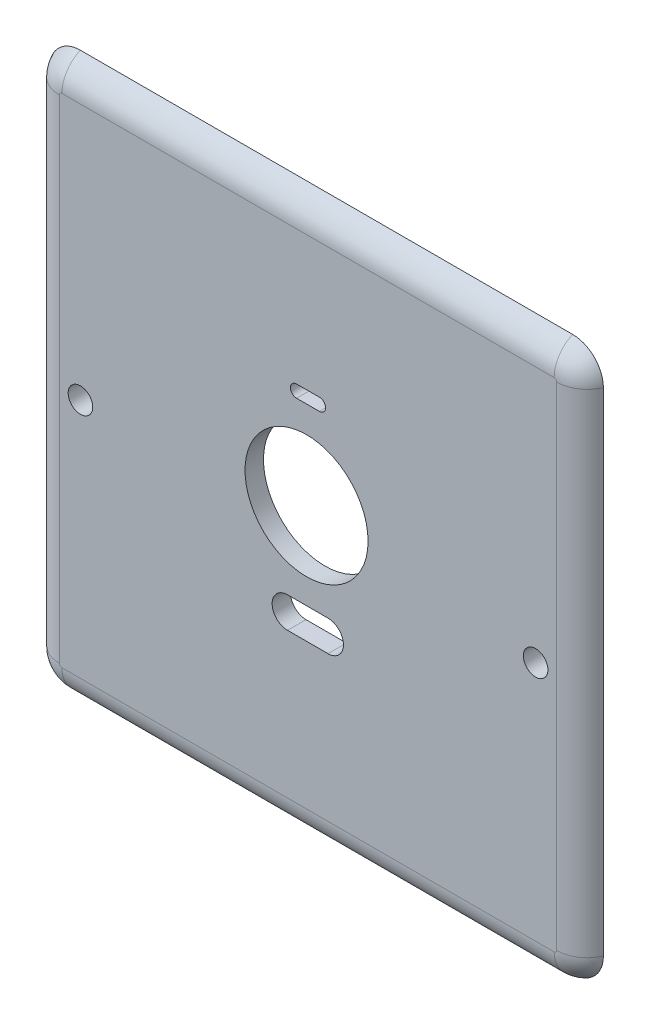
ISO-10303-21;
HEADER;
FILE_DESCRIPTION(('STEP AP214'),'2;1');
FILE_NAME('part.step','',(''),(''),'','','');
FILE_SCHEMA(('AUTOMOTIVE_DESIGN { 1 0 10303 214 1 1 1 1 }'));
ENDSEC;
DATA;
#1=APPLICATION_CONTEXT('core data for automotive mechanical design processes');
#2=APPLICATION_PROTOCOL_DEFINITION('international standard','automotive_design',2000,#1);
#3=PRODUCT_CONTEXT('',#1,'mechanical');
#4=PRODUCT('Part','Part','',(#3));
#5=PRODUCT_RELATED_PRODUCT_CATEGORY('part','',(#4));
#6=PRODUCT_DEFINITION_FORMATION('','',#4);
#7=PRODUCT_DEFINITION_CONTEXT('part definition',#1,'design');
#8=PRODUCT_DEFINITION('design','',#6,#7);
#9=PRODUCT_DEFINITION_SHAPE('','',#8);
#10=(LENGTH_UNIT() NAMED_UNIT(*) SI_UNIT(.MILLI.,.METRE.));
#11=(NAMED_UNIT(*) PLANE_ANGLE_UNIT() SI_UNIT($,.RADIAN.));
#12=(NAMED_UNIT(*) SI_UNIT($,.STERADIAN.) SOLID_ANGLE_UNIT());
#13=UNCERTAINTY_MEASURE_WITH_UNIT(LENGTH_MEASURE(1.E-05),#10,'distance_accuracy_value','');
#14=(GEOMETRIC_REPRESENTATION_CONTEXT(3) GLOBAL_UNCERTAINTY_ASSIGNED_CONTEXT((#13)) GLOBAL_UNIT_ASSIGNED_CONTEXT((#10,
#11,#12)) REPRESENTATION_CONTEXT('',''));
#15=CARTESIAN_POINT('',(0.,0.,0.));
#16=DIRECTION('',(0.,0.,1.));
#17=DIRECTION('',(1.,0.,0.));
#18=AXIS2_PLACEMENT_3D('',#15,#16,#17);
#19=CARTESIAN_POINT('',(0.,0.,3.));
#20=DIRECTION('',(0.,0.,1.));
#21=DIRECTION('',(1.,0.,0.));
#22=AXIS2_PLACEMENT_3D('',#19,#20,#21);
#23=PLANE('',#22);
#24=CARTESIAN_POINT('',(-54.5834797116528,-32.1286196555586,3.));
#25=DIRECTION('',(0.,0.,1.));
#26=DIRECTION('',(1.,0.,0.));
#27=AXIS2_PLACEMENT_3D('',#24,#25,#26);
#28=CIRCLE('',#27,2.5);
#29=CARTESIAN_POINT('',(-54.5834797116528,-29.6286196555586,3.));
#30=VERTEX_POINT('',#29);
#31=CARTESIAN_POINT('',(-54.5834797116528,-34.6286196555586,3.));
#32=VERTEX_POINT('',#31);
#33=EDGE_CURVE('E53',#30,#32,#28,.T.);
#34=ORIENTED_EDGE('',*,*,#33,.F.);
#35=DIRECTION('',(-1.,0.,0.));
#36=VECTOR('',#35,1.);
#37=CARTESIAN_POINT('',(-54.5834797116528,-29.6286196555586,3.));
#38=LINE('',#37,#36);
#39=CARTESIAN_POINT('',(-47.9966224562857,-29.6286196555586,3.));
#40=VERTEX_POINT('',#39);
#41=EDGE_CURVE('E172',#40,#30,#38,.T.);
#42=ORIENTED_EDGE('',*,*,#41,.F.);
#43=CARTESIAN_POINT('',(-47.9966224562857,-32.1286196555586,3.));
#44=DIRECTION('',(0.,0.,1.));
#45=DIRECTION('',(1.,0.,0.));
#46=AXIS2_PLACEMENT_3D('',#43,#44,#45);
#47=CIRCLE('',#46,2.5);
#48=CARTESIAN_POINT('',(-47.9966224562857,-34.6286196555586,3.));
#49=VERTEX_POINT('',#48);
#50=EDGE_CURVE('E175',#49,#40,#47,.T.);
#51=ORIENTED_EDGE('',*,*,#50,.F.);
#52=DIRECTION('',(1.,0.,0.));
#53=VECTOR('',#52,1.);
#54=CARTESIAN_POINT('',(-54.5834797116528,-34.6286196555586,3.));
#55=LINE('',#54,#53);
#56=EDGE_CURVE('E184',#32,#49,#55,.T.);
#57=ORIENTED_EDGE('',*,*,#56,.F.);
#58=EDGE_LOOP('',(#34,#42,#51,#57));
#59=FACE_BOUND('',#58,.T.);
#60=CARTESIAN_POINT('',(-53.1136142063013,-0.228696408480503,3.));
#61=DIRECTION('',(0.,0.,1.));
#62=DIRECTION('',(1.,0.,0.));
#63=AXIS2_PLACEMENT_3D('',#60,#61,#62);
#64=CIRCLE('',#63,1.);
#65=CARTESIAN_POINT('',(-53.1136142063013,0.771303591519498,3.));
#66=VERTEX_POINT('',#65);
#67=CARTESIAN_POINT('',(-53.1136142063013,-1.2286964084805,3.));
#68=VERTEX_POINT('',#67);
#69=EDGE_CURVE('E61',#66,#68,#64,.T.);
#70=ORIENTED_EDGE('',*,*,#69,.F.);
#71=DIRECTION('',(-1.,0.,0.));
#72=VECTOR('',#71,1.);
#73=CARTESIAN_POINT('',(-53.1136142063013,0.771303591519498,3.));
#74=LINE('',#73,#72);
#75=CARTESIAN_POINT('',(-49.3974603565752,0.771303591519498,3.));
#76=VERTEX_POINT('',#75);
#77=EDGE_CURVE('E199',#76,#66,#74,.T.);
#78=ORIENTED_EDGE('',*,*,#77,.F.);
#79=CARTESIAN_POINT('',(-49.3974603565752,-0.228696408480503,3.));
#80=DIRECTION('',(0.,0.,1.));
#81=DIRECTION('',(1.,0.,0.));
#82=AXIS2_PLACEMENT_3D('',#79,#80,#81);
#83=CIRCLE('',#82,1.);
#84=CARTESIAN_POINT('',(-49.3974603565752,-1.2286964084805,3.));
#85=VERTEX_POINT('',#84);
#86=EDGE_CURVE('E214',#85,#76,#83,.T.);
#87=ORIENTED_EDGE('',*,*,#86,.F.);
#88=DIRECTION('',(1.,0.,0.));
#89=VECTOR('',#88,1.);
#90=CARTESIAN_POINT('',(-53.1136142063013,-1.2286964084805,3.));
#91=LINE('',#90,#89);
#92=EDGE_CURVE('E210',#68,#85,#91,.T.);
#93=ORIENTED_EDGE('',*,*,#92,.F.);
#94=EDGE_LOOP('',(#70,#78,#87,#93));
#95=FACE_BOUND('',#94,.T.);
#96=CARTESIAN_POINT('',(-88.2383707673014,-19.0513449539287,3.));
#97=DIRECTION('',(0.,0.,1.));
#98=DIRECTION('',(1.,0.,0.));
#99=AXIS2_PLACEMENT_3D('',#96,#97,#98);
#100=CIRCLE('',#99,2.);
#101=CARTESIAN_POINT('',(-86.2383707673014,-19.0513449539287,3.));
#102=VERTEX_POINT('',#101);
#103=EDGE_CURVE('E381',#102,#102,#100,.T.);
#104=ORIENTED_EDGE('',*,*,#103,.F.);
#105=EDGE_LOOP('',(#104));
#106=FACE_BOUND('',#105,.T.);
#107=CARTESIAN_POINT('',(-14.2616292326987,-19.0513449539287,3.));
#108=DIRECTION('',(0.,0.,1.));
#109=DIRECTION('',(1.,0.,0.));
#110=AXIS2_PLACEMENT_3D('',#107,#108,#109);
#111=CIRCLE('',#110,2.);
#112=CARTESIAN_POINT('',(-12.2616292326987,-19.0513449539287,3.));
#113=VERTEX_POINT('',#112);
#114=EDGE_CURVE('E178',#113,#113,#111,.T.);
#115=ORIENTED_EDGE('',*,*,#114,.F.);
#116=EDGE_LOOP('',(#115));
#117=FACE_BOUND('',#116,.T.);
#118=CARTESIAN_POINT('',(-51.491961851315,-15.5450237044671,3.));
#119=DIRECTION('',(0.,0.,1.));
#120=DIRECTION('',(1.,0.,0.));
#121=AXIS2_PLACEMENT_3D('',#118,#119,#120);
#122=CIRCLE('',#121,10.);
#123=CARTESIAN_POINT('',(-41.491961851315,-15.5450237044671,3.));
#124=VERTEX_POINT('',#123);
#125=EDGE_CURVE('E191',#124,#124,#122,.T.);
#126=ORIENTED_EDGE('',*,*,#125,.F.);
#127=EDGE_LOOP('',(#126));
#128=FACE_BOUND('',#127,.T.);
#129=DIRECTION('',(1.,0.,0.));
#130=VECTOR('',#129,1.);
#131=CARTESIAN_POINT('',(-91.25,22.6049243050442,3.));
#132=LINE('',#131,#130);
#133=CARTESIAN_POINT('',(-11.25,22.6049243050442,3.));
#134=VERTEX_POINT('',#133);
#135=CARTESIAN_POINT('',(-91.25,22.6049243050442,3.));
#136=VERTEX_POINT('',#135);
#137=EDGE_CURVE('E45',#134,#136,#132,.F.);
#138=ORIENTED_EDGE('',*,*,#137,.T.);
#139=CARTESIAN_POINT('',(-91.25,22.1875,3.));
#140=DIRECTION('',(0.,0.,1.));
#141=DIRECTION('',(1.,0.,0.));
#142=AXIS2_PLACEMENT_3D('',#139,#140,#141);
#143=CIRCLE('',#142,0.41742430504416);
#144=CARTESIAN_POINT('',(-91.6674243050442,22.1875,3.));
#145=VERTEX_POINT('',#144);
#146=EDGE_CURVE('E11',#136,#145,#143,.T.);
#147=ORIENTED_EDGE('',*,*,#146,.T.);
#148=DIRECTION('',(0.,1.,0.));
#149=VECTOR('',#148,1.);
#150=CARTESIAN_POINT('',(-91.6674243050442,-57.8125,3.));
#151=LINE('',#150,#149);
#152=CARTESIAN_POINT('',(-91.6674243050442,-57.8125,3.));
#153=VERTEX_POINT('',#152);
#154=EDGE_CURVE('E252',#145,#153,#151,.F.);
#155=ORIENTED_EDGE('',*,*,#154,.T.);
#156=CARTESIAN_POINT('',(-91.25,-57.8125,3.));
#157=DIRECTION('',(0.,0.,1.));
#158=DIRECTION('',(1.,0.,0.));
#159=AXIS2_PLACEMENT_3D('',#156,#157,#158);
#160=CIRCLE('',#159,0.41742430504416);
#161=CARTESIAN_POINT('',(-91.25,-58.2299243050442,3.));
#162=VERTEX_POINT('',#161);
#163=EDGE_CURVE('E254',#153,#162,#160,.T.);
#164=ORIENTED_EDGE('',*,*,#163,.T.);
#165=DIRECTION('',(-1.,0.,0.));
#166=VECTOR('',#165,1.);
#167=CARTESIAN_POINT('',(-11.25,-58.2299243050442,3.));
#168=LINE('',#167,#166);
#169=CARTESIAN_POINT('',(-11.25,-58.2299243050442,3.));
#170=VERTEX_POINT('',#169);
#171=EDGE_CURVE('E256',#162,#170,#168,.F.);
#172=ORIENTED_EDGE('',*,*,#171,.T.);
#173=CARTESIAN_POINT('',(-11.25,-57.8125,3.));
#174=DIRECTION('',(0.,0.,1.));
#175=DIRECTION('',(1.,0.,0.));
#176=AXIS2_PLACEMENT_3D('',#173,#174,#175);
#177=CIRCLE('',#176,0.41742430504416);
#178=CARTESIAN_POINT('',(-10.8325756949558,-57.8125,3.));
#179=VERTEX_POINT('',#178);
#180=EDGE_CURVE('E258',#170,#179,#177,.T.);
#181=ORIENTED_EDGE('',*,*,#180,.T.);
#182=DIRECTION('',(0.,-1.,0.));
#183=VECTOR('',#182,1.);
#184=CARTESIAN_POINT('',(-10.8325756949559,22.1875,3.));
#185=LINE('',#184,#183);
#186=CARTESIAN_POINT('',(-10.8325756949559,22.1875,3.));
#187=VERTEX_POINT('',#186);
#188=EDGE_CURVE('E260',#179,#187,#185,.F.);
#189=ORIENTED_EDGE('',*,*,#188,.T.);
#190=CARTESIAN_POINT('',(-11.25,22.1875,3.));
#191=DIRECTION('',(0.,0.,1.));
#192=DIRECTION('',(1.,0.,0.));
#193=AXIS2_PLACEMENT_3D('',#190,#191,#192);
#194=CIRCLE('',#193,0.41742430504416);
#195=EDGE_CURVE('E262',#187,#134,#194,.T.);
#196=ORIENTED_EDGE('',*,*,#195,.T.);
#197=EDGE_LOOP('',(#138,#147,#155,#164,#172,#181,#189,#196));
#198=FACE_BOUND('',#197,.T.);
#199=ADVANCED_FACE('F36',(#59,#95,#106,#117,#128,#198),#23,.T.);
#200=CARTESIAN_POINT('',(0.,0.,0.));
#201=DIRECTION('',(0.,0.,1.));
#202=DIRECTION('',(1.,0.,0.));
#203=AXIS2_PLACEMENT_3D('',#200,#201,#202);
#204=PLANE('',#203);
#205=DIRECTION('',(-1.,0.,0.));
#206=VECTOR('',#205,1.);
#207=CARTESIAN_POINT('',(-54.5834797116528,-29.6286196555586,0.));
#208=LINE('',#207,#206);
#209=CARTESIAN_POINT('',(-47.9966224562857,-29.6286196555586,0.));
#210=VERTEX_POINT('',#209);
#211=CARTESIAN_POINT('',(-54.5834797116528,-29.6286196555586,0.));
#212=VERTEX_POINT('',#211);
#213=EDGE_CURVE('E159',#210,#212,#208,.T.);
#214=ORIENTED_EDGE('',*,*,#213,.T.);
#215=CARTESIAN_POINT('',(-54.5834797116528,-32.1286196555586,0.));
#216=DIRECTION('',(0.,0.,1.));
#217=DIRECTION('',(1.,0.,0.));
#218=AXIS2_PLACEMENT_3D('',#215,#216,#217);
#219=CIRCLE('',#218,2.5);
#220=CARTESIAN_POINT('',(-54.5834797116528,-34.6286196555586,0.));
#221=VERTEX_POINT('',#220);
#222=EDGE_CURVE('E153',#212,#221,#219,.T.);
#223=ORIENTED_EDGE('',*,*,#222,.T.);
#224=DIRECTION('',(1.,0.,0.));
#225=VECTOR('',#224,1.);
#226=CARTESIAN_POINT('',(-54.5834797116528,-34.6286196555586,0.));
#227=LINE('',#226,#225);
#228=CARTESIAN_POINT('',(-47.9966224562857,-34.6286196555586,0.));
#229=VERTEX_POINT('',#228);
#230=EDGE_CURVE('E163',#221,#229,#227,.T.);
#231=ORIENTED_EDGE('',*,*,#230,.T.);
#232=CARTESIAN_POINT('',(-47.9966224562857,-32.1286196555586,0.));
#233=DIRECTION('',(0.,0.,1.));
#234=DIRECTION('',(1.,0.,0.));
#235=AXIS2_PLACEMENT_3D('',#232,#233,#234);
#236=CIRCLE('',#235,2.5);
#237=EDGE_CURVE('E167',#229,#210,#236,.T.);
#238=ORIENTED_EDGE('',*,*,#237,.T.);
#239=EDGE_LOOP('',(#214,#223,#231,#238));
#240=FACE_BOUND('',#239,.T.);
#241=DIRECTION('',(-1.,0.,0.));
#242=VECTOR('',#241,1.);
#243=CARTESIAN_POINT('',(-53.1136142063013,0.771303591519498,0.));
#244=LINE('',#243,#242);
#245=CARTESIAN_POINT('',(-49.3974603565752,0.771303591519498,0.));
#246=VERTEX_POINT('',#245);
#247=CARTESIAN_POINT('',(-53.1136142063013,0.771303591519498,0.));
#248=VERTEX_POINT('',#247);
#249=EDGE_CURVE('E205',#246,#248,#244,.T.);
#250=ORIENTED_EDGE('',*,*,#249,.T.);
#251=CARTESIAN_POINT('',(-53.1136142063013,-0.228696408480503,0.));
#252=DIRECTION('',(0.,0.,1.));
#253=DIRECTION('',(1.,0.,0.));
#254=AXIS2_PLACEMENT_3D('',#251,#252,#253);
#255=CIRCLE('',#254,1.);
#256=CARTESIAN_POINT('',(-53.1136142063013,-1.2286964084805,0.));
#257=VERTEX_POINT('',#256);
#258=EDGE_CURVE('E195',#248,#257,#255,.T.);
#259=ORIENTED_EDGE('',*,*,#258,.T.);
#260=DIRECTION('',(1.,0.,0.));
#261=VECTOR('',#260,1.);
#262=CARTESIAN_POINT('',(-53.1136142063013,-1.2286964084805,0.));
#263=LINE('',#262,#261);
#264=CARTESIAN_POINT('',(-49.3974603565752,-1.2286964084805,0.));
#265=VERTEX_POINT('',#264);
#266=EDGE_CURVE('E198',#257,#265,#263,.T.);
#267=ORIENTED_EDGE('',*,*,#266,.T.);
#268=CARTESIAN_POINT('',(-49.3974603565752,-0.228696408480503,0.));
#269=DIRECTION('',(0.,0.,1.));
#270=DIRECTION('',(1.,0.,0.));
#271=AXIS2_PLACEMENT_3D('',#268,#269,#270);
#272=CIRCLE('',#271,1.);
#273=EDGE_CURVE('E202',#265,#246,#272,.T.);
#274=ORIENTED_EDGE('',*,*,#273,.T.);
#275=EDGE_LOOP('',(#250,#259,#267,#274));
#276=FACE_BOUND('',#275,.T.);
#277=CARTESIAN_POINT('',(-88.2383707673014,-19.0513449539287,0.));
#278=DIRECTION('',(0.,0.,1.));
#279=DIRECTION('',(1.,0.,0.));
#280=AXIS2_PLACEMENT_3D('',#277,#278,#279);
#281=CIRCLE('',#280,2.);
#282=CARTESIAN_POINT('',(-86.2383707673014,-19.0513449539287,0.));
#283=VERTEX_POINT('',#282);
#284=EDGE_CURVE('E211',#283,#283,#281,.T.);
#285=ORIENTED_EDGE('',*,*,#284,.T.);
#286=EDGE_LOOP('',(#285));
#287=FACE_BOUND('',#286,.T.);
#288=CARTESIAN_POINT('',(-14.2616292326987,-19.0513449539287,0.));
#289=DIRECTION('',(0.,0.,1.));
#290=DIRECTION('',(1.,0.,0.));
#291=AXIS2_PLACEMENT_3D('',#288,#289,#290);
#292=CIRCLE('',#291,2.);
#293=CARTESIAN_POINT('',(-12.2616292326987,-19.0513449539287,0.));
#294=VERTEX_POINT('',#293);
#295=EDGE_CURVE('E383',#294,#294,#292,.T.);
#296=ORIENTED_EDGE('',*,*,#295,.T.);
#297=EDGE_LOOP('',(#296));
#298=FACE_BOUND('',#297,.T.);
#299=CARTESIAN_POINT('',(-51.491961851315,-15.5450237044671,0.));
#300=DIRECTION('',(0.,0.,1.));
#301=DIRECTION('',(1.,0.,0.));
#302=AXIS2_PLACEMENT_3D('',#299,#300,#301);
#303=CIRCLE('',#302,10.);
#304=CARTESIAN_POINT('',(-41.491961851315,-15.5450237044671,0.));
#305=VERTEX_POINT('',#304);
#306=EDGE_CURVE('E225',#305,#305,#303,.T.);
#307=ORIENTED_EDGE('',*,*,#306,.T.);
#308=EDGE_LOOP('',(#307));
#309=FACE_BOUND('',#308,.T.);
#310=DIRECTION('',(0.,-1.,0.));
#311=VECTOR('',#310,1.);
#312=CARTESIAN_POINT('',(-96.25,27.1875,0.));
#313=LINE('',#312,#311);
#314=CARTESIAN_POINT('',(-96.25,22.1875,0.));
#315=VERTEX_POINT('',#314);
#316=CARTESIAN_POINT('',(-96.25,-57.8125,0.));
#317=VERTEX_POINT('',#316);
#318=EDGE_CURVE('E231',#315,#317,#313,.T.);
#319=ORIENTED_EDGE('',*,*,#318,.F.);
#320=CARTESIAN_POINT('',(-91.25,22.1875,0.));
#321=DIRECTION('',(0.,0.,1.));
#322=DIRECTION('',(1.,0.,0.));
#323=AXIS2_PLACEMENT_3D('',#320,#321,#322);
#324=CIRCLE('',#323,5.);
#325=CARTESIAN_POINT('',(-91.25,27.1875,0.));
#326=VERTEX_POINT('',#325);
#327=EDGE_CURVE('E249',#315,#326,#324,.F.);
#328=ORIENTED_EDGE('',*,*,#327,.T.);
#329=DIRECTION('',(-1.,0.,0.));
#330=VECTOR('',#329,1.);
#331=CARTESIAN_POINT('',(-96.25,27.1875,0.));
#332=LINE('',#331,#330);
#333=CARTESIAN_POINT('',(-11.2500000000001,27.1875,0.));
#334=VERTEX_POINT('',#333);
#335=EDGE_CURVE('E240',#334,#326,#332,.T.);
#336=ORIENTED_EDGE('',*,*,#335,.F.);
#337=CARTESIAN_POINT('',(-11.25,22.1875,0.));
#338=DIRECTION('',(0.,0.,1.));
#339=DIRECTION('',(1.,0.,0.));
#340=AXIS2_PLACEMENT_3D('',#337,#338,#339);
#341=CIRCLE('',#340,5.);
#342=CARTESIAN_POINT('',(-6.25000000000002,22.1875,0.));
#343=VERTEX_POINT('',#342);
#344=EDGE_CURVE('E247',#334,#343,#341,.F.);
#345=ORIENTED_EDGE('',*,*,#344,.T.);
#346=DIRECTION('',(0.,1.,0.));
#347=VECTOR('',#346,1.);
#348=CARTESIAN_POINT('',(-6.25000000000002,27.1875,0.));
#349=LINE('',#348,#347);
#350=CARTESIAN_POINT('',(-6.25000000000001,-57.8125,0.));
#351=VERTEX_POINT('',#350);
#352=EDGE_CURVE('E237',#351,#343,#349,.T.);
#353=ORIENTED_EDGE('',*,*,#352,.F.);
#354=CARTESIAN_POINT('',(-11.25,-57.8125,0.));
#355=DIRECTION('',(0.,0.,1.));
#356=DIRECTION('',(1.,0.,0.));
#357=AXIS2_PLACEMENT_3D('',#354,#355,#356);
#358=CIRCLE('',#357,5.);
#359=CARTESIAN_POINT('',(-11.25,-62.8125,0.));
#360=VERTEX_POINT('',#359);
#361=EDGE_CURVE('E245',#351,#360,#358,.F.);
#362=ORIENTED_EDGE('',*,*,#361,.T.);
#363=DIRECTION('',(1.,0.,0.));
#364=VECTOR('',#363,1.);
#365=CARTESIAN_POINT('',(-96.25,-62.8125,0.));
#366=LINE('',#365,#364);
#367=CARTESIAN_POINT('',(-91.25,-62.8125,0.));
#368=VERTEX_POINT('',#367);
#369=EDGE_CURVE('E234',#368,#360,#366,.T.);
#370=ORIENTED_EDGE('',*,*,#369,.F.);
#371=CARTESIAN_POINT('',(-91.25,-57.8125,0.));
#372=DIRECTION('',(0.,0.,1.));
#373=DIRECTION('',(1.,0.,0.));
#374=AXIS2_PLACEMENT_3D('',#371,#372,#373);
#375=CIRCLE('',#374,5.);
#376=EDGE_CURVE('E243',#368,#317,#375,.F.);
#377=ORIENTED_EDGE('',*,*,#376,.T.);
#378=EDGE_LOOP('',(#319,#328,#336,#345,#353,#362,#370,#377));
#379=FACE_BOUND('',#378,.T.);
#380=ADVANCED_FACE('F169',(#240,#276,#287,#298,#309,#379),#204,.F.);
#381=CARTESIAN_POINT('',(-11.25,-57.8125,-2.));
#382=DIRECTION('',(0.,0.,-1.));
#383=DIRECTION('',(-1.,0.,0.));
#384=AXIS2_PLACEMENT_3D('',#381,#382,#383);
#385=DEGENERATE_TOROIDAL_SURFACE('',#384,0.41742430504416,5.,.T.);
#386=CARTESIAN_POINT('',(-11.25,-58.2299243050442,-2.));
#387=DIRECTION('',(-1.,0.,0.));
#388=DIRECTION('',(0.,-1.,0.));
#389=AXIS2_PLACEMENT_3D('',#386,#387,#388);
#390=CIRCLE('',#389,5.);
#391=EDGE_CURVE('E279',#360,#170,#390,.T.);
#392=ORIENTED_EDGE('',*,*,#391,.F.);
#393=ORIENTED_EDGE('',*,*,#361,.F.);
#394=CARTESIAN_POINT('',(-10.8325756949558,-57.8125,-2.));
#395=DIRECTION('',(0.,1.,0.));
#396=DIRECTION('',(-1.,0.,0.));
#397=AXIS2_PLACEMENT_3D('',#394,#395,#396);
#398=CIRCLE('',#397,5.);
#399=EDGE_CURVE('E40',#179,#351,#398,.T.);
#400=ORIENTED_EDGE('',*,*,#399,.F.);
#401=ORIENTED_EDGE('',*,*,#180,.F.);
#402=EDGE_LOOP('',(#392,#393,#400,#401));
#403=FACE_BOUND('',#402,.T.);
#404=ADVANCED_FACE('F38',(#403),#385,.T.);
#405=CARTESIAN_POINT('',(-10.8325756949559,27.1875,-2.));
#406=DIRECTION('',(0.,1.,0.));
#407=DIRECTION('',(-1.,0.,0.));
#408=AXIS2_PLACEMENT_3D('',#405,#406,#407);
#409=CYLINDRICAL_SURFACE('',#408,5.);
#410=ORIENTED_EDGE('',*,*,#399,.T.);
#411=ORIENTED_EDGE('',*,*,#352,.T.);
#412=CARTESIAN_POINT('',(-10.8325756949559,22.1875,-2.));
#413=DIRECTION('',(0.,1.,0.));
#414=DIRECTION('',(0.,0.,1.));
#415=AXIS2_PLACEMENT_3D('',#412,#413,#414);
#416=CIRCLE('',#415,5.);
#417=EDGE_CURVE('E277',#187,#343,#416,.T.);
#418=ORIENTED_EDGE('',*,*,#417,.F.);
#419=ORIENTED_EDGE('',*,*,#188,.F.);
#420=EDGE_LOOP('',(#410,#411,#418,#419));
#421=FACE_BOUND('',#420,.T.);
#422=ADVANCED_FACE('F288',(#421),#409,.T.);
#423=CARTESIAN_POINT('',(-96.25,-58.2299243050442,-2.));
#424=DIRECTION('',(1.,0.,0.));
#425=DIRECTION('',(0.,0.,-1.));
#426=AXIS2_PLACEMENT_3D('',#423,#424,#425);
#427=CYLINDRICAL_SURFACE('',#426,5.);
#428=ORIENTED_EDGE('',*,*,#391,.T.);
#429=ORIENTED_EDGE('',*,*,#171,.F.);
#430=CARTESIAN_POINT('',(-91.25,-58.2299243050442,-2.));
#431=DIRECTION('',(-1.,0.,0.));
#432=DIRECTION('',(0.,0.,1.));
#433=AXIS2_PLACEMENT_3D('',#430,#431,#432);
#434=CIRCLE('',#433,5.);
#435=EDGE_CURVE('E274',#368,#162,#434,.T.);
#436=ORIENTED_EDGE('',*,*,#435,.F.);
#437=ORIENTED_EDGE('',*,*,#369,.T.);
#438=EDGE_LOOP('',(#428,#429,#436,#437));
#439=FACE_BOUND('',#438,.T.);
#440=ADVANCED_FACE('F307',(#439),#427,.T.);
#441=CARTESIAN_POINT('',(-11.25,22.1875,-2.));
#442=DIRECTION('',(0.,0.,-1.));
#443=DIRECTION('',(-1.,0.,0.));
#444=AXIS2_PLACEMENT_3D('',#441,#442,#443);
#445=DEGENERATE_TOROIDAL_SURFACE('',#444,0.41742430504416,5.,.T.);
#446=ORIENTED_EDGE('',*,*,#417,.T.);
#447=ORIENTED_EDGE('',*,*,#344,.F.);
#448=CARTESIAN_POINT('',(-11.25,22.6049243050442,-2.));
#449=DIRECTION('',(-1.,0.,0.));
#450=DIRECTION('',(0.,-1.,0.));
#451=AXIS2_PLACEMENT_3D('',#448,#449,#450);
#452=CIRCLE('',#451,5.);
#453=EDGE_CURVE('E271',#134,#334,#452,.T.);
#454=ORIENTED_EDGE('',*,*,#453,.F.);
#455=ORIENTED_EDGE('',*,*,#195,.F.);
#456=EDGE_LOOP('',(#446,#447,#454,#455));
#457=FACE_BOUND('',#456,.T.);
#458=ADVANCED_FACE('F298',(#457),#445,.T.);
#459=CARTESIAN_POINT('',(-91.25,-57.8125,-2.));
#460=DIRECTION('',(0.,0.,-1.));
#461=DIRECTION('',(-1.,0.,0.));
#462=AXIS2_PLACEMENT_3D('',#459,#460,#461);
#463=DEGENERATE_TOROIDAL_SURFACE('',#462,0.41742430504416,5.,.T.);
#464=ORIENTED_EDGE('',*,*,#435,.T.);
#465=ORIENTED_EDGE('',*,*,#163,.F.);
#466=CARTESIAN_POINT('',(-91.6674243050442,-57.8125,-2.));
#467=DIRECTION('',(0.,1.,0.));
#468=DIRECTION('',(-1.,0.,0.));
#469=AXIS2_PLACEMENT_3D('',#466,#467,#468);
#470=CIRCLE('',#469,5.);
#471=EDGE_CURVE('E268',#317,#153,#470,.T.);
#472=ORIENTED_EDGE('',*,*,#471,.F.);
#473=ORIENTED_EDGE('',*,*,#376,.F.);
#474=EDGE_LOOP('',(#464,#465,#472,#473));
#475=FACE_BOUND('',#474,.T.);
#476=ADVANCED_FACE('F310',(#475),#463,.T.);
#477=CARTESIAN_POINT('',(-96.25,22.6049243050442,-2.));
#478=DIRECTION('',(-1.,0.,0.));
#479=DIRECTION('',(0.,0.,1.));
#480=AXIS2_PLACEMENT_3D('',#477,#478,#479);
#481=CYLINDRICAL_SURFACE('',#480,5.);
#482=ORIENTED_EDGE('',*,*,#453,.T.);
#483=ORIENTED_EDGE('',*,*,#335,.T.);
#484=CARTESIAN_POINT('',(-91.25,22.6049243050442,-2.));
#485=DIRECTION('',(-1.,0.,0.));
#486=DIRECTION('',(0.,0.,1.));
#487=AXIS2_PLACEMENT_3D('',#484,#485,#486);
#488=CIRCLE('',#487,5.);
#489=EDGE_CURVE('E266',#136,#326,#488,.T.);
#490=ORIENTED_EDGE('',*,*,#489,.F.);
#491=ORIENTED_EDGE('',*,*,#137,.F.);
#492=EDGE_LOOP('',(#482,#483,#490,#491));
#493=FACE_BOUND('',#492,.T.);
#494=ADVANCED_FACE('F302',(#493),#481,.T.);
#495=CARTESIAN_POINT('',(-91.6674243050442,27.1875,-2.));
#496=DIRECTION('',(0.,-1.,0.));
#497=DIRECTION('',(0.,0.,-1.));
#498=AXIS2_PLACEMENT_3D('',#495,#496,#497);
#499=CYLINDRICAL_SURFACE('',#498,5.);
#500=ORIENTED_EDGE('',*,*,#471,.T.);
#501=ORIENTED_EDGE('',*,*,#154,.F.);
#502=CARTESIAN_POINT('',(-91.6674243050442,22.1875,-2.));
#503=DIRECTION('',(0.,1.,0.));
#504=DIRECTION('',(0.,0.,1.));
#505=AXIS2_PLACEMENT_3D('',#502,#503,#504);
#506=CIRCLE('',#505,5.);
#507=EDGE_CURVE('E228',#315,#145,#506,.T.);
#508=ORIENTED_EDGE('',*,*,#507,.F.);
#509=ORIENTED_EDGE('',*,*,#318,.T.);
#510=EDGE_LOOP('',(#500,#501,#508,#509));
#511=FACE_BOUND('',#510,.T.);
#512=ADVANCED_FACE('F318',(#511),#499,.T.);
#513=CARTESIAN_POINT('',(-91.25,22.1875,-2.));
#514=DIRECTION('',(0.,0.,-1.));
#515=DIRECTION('',(-1.,0.,0.));
#516=AXIS2_PLACEMENT_3D('',#513,#514,#515);
#517=DEGENERATE_TOROIDAL_SURFACE('',#516,0.41742430504416,5.,.T.);
#518=ORIENTED_EDGE('',*,*,#489,.T.);
#519=ORIENTED_EDGE('',*,*,#327,.F.);
#520=ORIENTED_EDGE('',*,*,#507,.T.);
#521=ORIENTED_EDGE('',*,*,#146,.F.);
#522=EDGE_LOOP('',(#518,#519,#520,#521));
#523=FACE_BOUND('',#522,.T.);
#524=ADVANCED_FACE('F316',(#523),#517,.T.);
#525=CARTESIAN_POINT('',(-51.491961851315,-15.5450237044671,0.));
#526=DIRECTION('',(0.,0.,1.));
#527=DIRECTION('',(1.,0.,0.));
#528=AXIS2_PLACEMENT_3D('',#525,#526,#527);
#529=CYLINDRICAL_SURFACE('',#528,10.);
#530=ORIENTED_EDGE('',*,*,#306,.F.);
#531=EDGE_LOOP('',(#530));
#532=FACE_BOUND('',#531,.T.);
#533=ORIENTED_EDGE('',*,*,#125,.T.);
#534=EDGE_LOOP('',(#533));
#535=FACE_BOUND('',#534,.T.);
#536=ADVANCED_FACE('F325',(#532,#535),#529,.F.);
#537=CARTESIAN_POINT('',(-14.2616292326987,-19.0513449539287,0.));
#538=DIRECTION('',(0.,0.,1.));
#539=DIRECTION('',(1.,0.,0.));
#540=AXIS2_PLACEMENT_3D('',#537,#538,#539);
#541=CYLINDRICAL_SURFACE('',#540,2.);
#542=ORIENTED_EDGE('',*,*,#295,.F.);
#543=EDGE_LOOP('',(#542));
#544=FACE_BOUND('',#543,.T.);
#545=ORIENTED_EDGE('',*,*,#114,.T.);
#546=EDGE_LOOP('',(#545));
#547=FACE_BOUND('',#546,.T.);
#548=ADVANCED_FACE('F339',(#544,#547),#541,.F.);
#549=CARTESIAN_POINT('',(-88.2383707673014,-19.0513449539287,0.));
#550=DIRECTION('',(0.,0.,1.));
#551=DIRECTION('',(1.,0.,0.));
#552=AXIS2_PLACEMENT_3D('',#549,#550,#551);
#553=CYLINDRICAL_SURFACE('',#552,2.);
#554=ORIENTED_EDGE('',*,*,#284,.F.);
#555=EDGE_LOOP('',(#554));
#556=FACE_BOUND('',#555,.T.);
#557=ORIENTED_EDGE('',*,*,#103,.T.);
#558=EDGE_LOOP('',(#557));
#559=FACE_BOUND('',#558,.T.);
#560=ADVANCED_FACE('F345',(#556,#559),#553,.F.);
#561=CARTESIAN_POINT('',(-53.1136142063013,-0.228696408480503,0.));
#562=DIRECTION('',(0.,0.,1.));
#563=DIRECTION('',(1.,0.,0.));
#564=AXIS2_PLACEMENT_3D('',#561,#562,#563);
#565=CYLINDRICAL_SURFACE('',#564,1.);
#566=ORIENTED_EDGE('',*,*,#69,.T.);
#567=DIRECTION('',(0.,0.,1.));
#568=VECTOR('',#567,1.);
#569=CARTESIAN_POINT('',(-53.1136142063013,-1.2286964084805,0.));
#570=LINE('',#569,#568);
#571=EDGE_CURVE('E208',#257,#68,#570,.T.);
#572=ORIENTED_EDGE('',*,*,#571,.F.);
#573=ORIENTED_EDGE('',*,*,#258,.F.);
#574=DIRECTION('',(0.,0.,1.));
#575=VECTOR('',#574,1.);
#576=CARTESIAN_POINT('',(-53.1136142063013,0.771303591519498,0.));
#577=LINE('',#576,#575);
#578=EDGE_CURVE('E185',#248,#66,#577,.T.);
#579=ORIENTED_EDGE('',*,*,#578,.T.);
#580=EDGE_LOOP('',(#566,#572,#573,#579));
#581=FACE_BOUND('',#580,.T.);
#582=ADVANCED_FACE('F341',(#581),#565,.F.);
#583=CARTESIAN_POINT('',(-53.1136142063013,0.771303591519498,0.));
#584=DIRECTION('',(0.,1.,0.));
#585=DIRECTION('',(0.,0.,1.));
#586=AXIS2_PLACEMENT_3D('',#583,#584,#585);
#587=PLANE('',#586);
#588=ORIENTED_EDGE('',*,*,#77,.T.);
#589=ORIENTED_EDGE('',*,*,#578,.F.);
#590=ORIENTED_EDGE('',*,*,#249,.F.);
#591=DIRECTION('',(0.,0.,1.));
#592=VECTOR('',#591,1.);
#593=CARTESIAN_POINT('',(-49.3974603565752,0.771303591519498,0.));
#594=LINE('',#593,#592);
#595=EDGE_CURVE('E220',#246,#76,#594,.T.);
#596=ORIENTED_EDGE('',*,*,#595,.T.);
#597=EDGE_LOOP('',(#588,#589,#590,#596));
#598=FACE_BOUND('',#597,.T.);
#599=ADVANCED_FACE('F344',(#598),#587,.F.);
#600=CARTESIAN_POINT('',(-49.3974603565752,-0.228696408480503,0.));
#601=DIRECTION('',(0.,0.,1.));
#602=DIRECTION('',(1.,0.,0.));
#603=AXIS2_PLACEMENT_3D('',#600,#601,#602);
#604=CYLINDRICAL_SURFACE('',#603,1.);
#605=ORIENTED_EDGE('',*,*,#86,.T.);
#606=ORIENTED_EDGE('',*,*,#595,.F.);
#607=ORIENTED_EDGE('',*,*,#273,.F.);
#608=DIRECTION('',(0.,0.,1.));
#609=VECTOR('',#608,1.);
#610=CARTESIAN_POINT('',(-49.3974603565752,-1.2286964084805,0.));
#611=LINE('',#610,#609);
#612=EDGE_CURVE('E222',#265,#85,#611,.T.);
#613=ORIENTED_EDGE('',*,*,#612,.T.);
#614=EDGE_LOOP('',(#605,#606,#607,#613));
#615=FACE_BOUND('',#614,.T.);
#616=ADVANCED_FACE('F349',(#615),#604,.F.);
#617=CARTESIAN_POINT('',(-53.1136142063013,-1.2286964084805,0.));
#618=DIRECTION('',(0.,-1.,0.));
#619=DIRECTION('',(0.,0.,-1.));
#620=AXIS2_PLACEMENT_3D('',#617,#618,#619);
#621=PLANE('',#620);
#622=ORIENTED_EDGE('',*,*,#92,.T.);
#623=ORIENTED_EDGE('',*,*,#612,.F.);
#624=ORIENTED_EDGE('',*,*,#266,.F.);
#625=ORIENTED_EDGE('',*,*,#571,.T.);
#626=EDGE_LOOP('',(#622,#623,#624,#625));
#627=FACE_BOUND('',#626,.T.);
#628=ADVANCED_FACE('F346',(#627),#621,.F.);
#629=CARTESIAN_POINT('',(-54.5834797116528,-32.1286196555586,0.));
#630=DIRECTION('',(0.,0.,1.));
#631=DIRECTION('',(1.,0.,0.));
#632=AXIS2_PLACEMENT_3D('',#629,#630,#631);
#633=CYLINDRICAL_SURFACE('',#632,2.5);
#634=ORIENTED_EDGE('',*,*,#33,.T.);
#635=DIRECTION('',(0.,0.,1.));
#636=VECTOR('',#635,1.);
#637=CARTESIAN_POINT('',(-54.5834797116528,-34.6286196555586,0.));
#638=LINE('',#637,#636);
#639=EDGE_CURVE('E149',#221,#32,#638,.T.);
#640=ORIENTED_EDGE('',*,*,#639,.F.);
#641=ORIENTED_EDGE('',*,*,#222,.F.);
#642=DIRECTION('',(0.,0.,1.));
#643=VECTOR('',#642,1.);
#644=CARTESIAN_POINT('',(-54.5834797116528,-29.6286196555586,0.));
#645=LINE('',#644,#643);
#646=EDGE_CURVE('E189',#212,#30,#645,.T.);
#647=ORIENTED_EDGE('',*,*,#646,.T.);
#648=EDGE_LOOP('',(#634,#640,#641,#647));
#649=FACE_BOUND('',#648,.T.);
#650=ADVANCED_FACE('F151',(#649),#633,.F.);
#651=CARTESIAN_POINT('',(-54.5834797116528,-29.6286196555586,0.));
#652=DIRECTION('',(0.,1.,0.));
#653=DIRECTION('',(0.,0.,1.));
#654=AXIS2_PLACEMENT_3D('',#651,#652,#653);
#655=PLANE('',#654);
#656=ORIENTED_EDGE('',*,*,#41,.T.);
#657=ORIENTED_EDGE('',*,*,#646,.F.);
#658=ORIENTED_EDGE('',*,*,#213,.F.);
#659=DIRECTION('',(0.,0.,1.));
#660=VECTOR('',#659,1.);
#661=CARTESIAN_POINT('',(-47.9966224562857,-29.6286196555586,0.));
#662=LINE('',#661,#660);
#663=EDGE_CURVE('E192',#210,#40,#662,.T.);
#664=ORIENTED_EDGE('',*,*,#663,.T.);
#665=EDGE_LOOP('',(#656,#657,#658,#664));
#666=FACE_BOUND('',#665,.T.);
#667=ADVANCED_FACE('F359',(#666),#655,.F.);
#668=CARTESIAN_POINT('',(-47.9966224562857,-32.1286196555586,0.));
#669=DIRECTION('',(0.,0.,1.));
#670=DIRECTION('',(1.,0.,0.));
#671=AXIS2_PLACEMENT_3D('',#668,#669,#670);
#672=CYLINDRICAL_SURFACE('',#671,2.5);
#673=ORIENTED_EDGE('',*,*,#50,.T.);
#674=ORIENTED_EDGE('',*,*,#663,.F.);
#675=ORIENTED_EDGE('',*,*,#237,.F.);
#676=DIRECTION('',(0.,0.,1.));
#677=VECTOR('',#676,1.);
#678=CARTESIAN_POINT('',(-47.9966224562857,-34.6286196555586,0.));
#679=LINE('',#678,#677);
#680=EDGE_CURVE('E158',#229,#49,#679,.T.);
#681=ORIENTED_EDGE('',*,*,#680,.T.);
#682=EDGE_LOOP('',(#673,#674,#675,#681));
#683=FACE_BOUND('',#682,.T.);
#684=ADVANCED_FACE('F362',(#683),#672,.F.);
#685=CARTESIAN_POINT('',(-54.5834797116528,-34.6286196555586,0.));
#686=DIRECTION('',(0.,-1.,0.));
#687=DIRECTION('',(0.,0.,-1.));
#688=AXIS2_PLACEMENT_3D('',#685,#686,#687);
#689=PLANE('',#688);
#690=ORIENTED_EDGE('',*,*,#56,.T.);
#691=ORIENTED_EDGE('',*,*,#680,.F.);
#692=ORIENTED_EDGE('',*,*,#230,.F.);
#693=ORIENTED_EDGE('',*,*,#639,.T.);
#694=EDGE_LOOP('',(#690,#691,#692,#693));
#695=FACE_BOUND('',#694,.T.);
#696=ADVANCED_FACE('F164',(#695),#689,.F.);
#697=CLOSED_SHELL('',(#199,#380,#404,#422,#440,#458,#476,#494,#512,#524,#536,#548,#560,#582,
#599,#616,#628,#650,#667,#684,#696));
#698=MANIFOLD_SOLID_BREP('B2',#697);
#699=ADVANCED_BREP_SHAPE_REPRESENTATION('',(#18,#698),#14);
#700=SHAPE_DEFINITION_REPRESENTATION(#9,#699);
ENDSEC;
END-ISO-10303-21;
